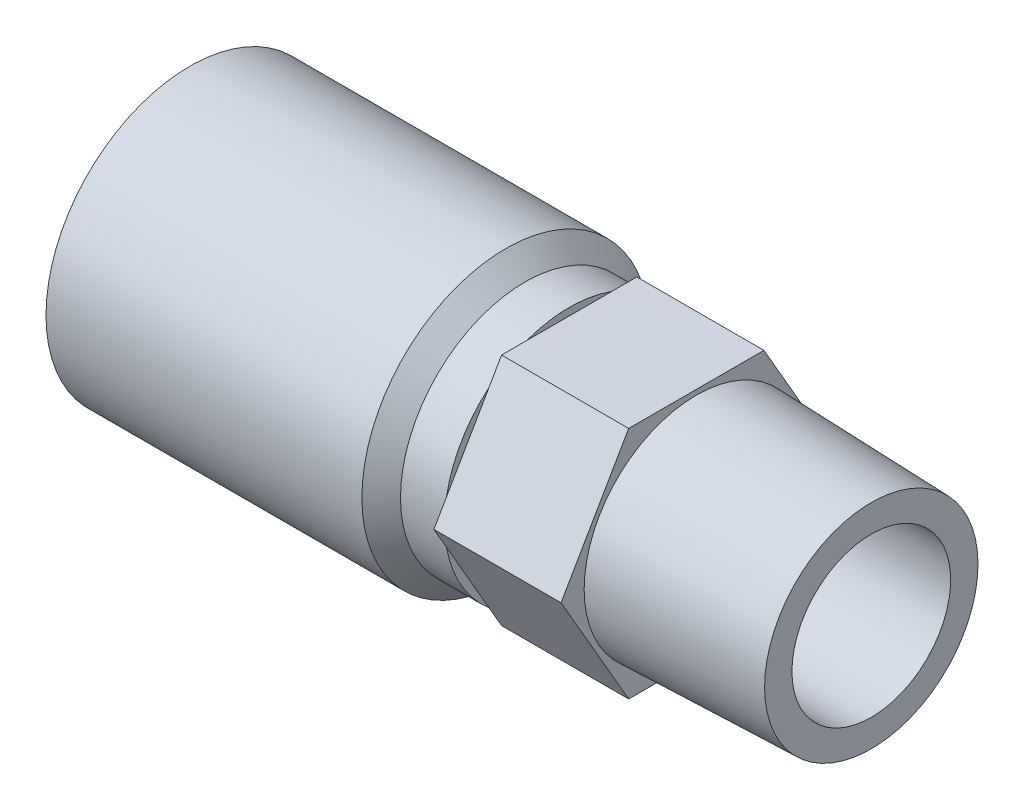
ISO-10303-21;
HEADER;
FILE_DESCRIPTION(('STEP AP214'),'2;1');
FILE_NAME('part.step','',(''),(''),'','','');
FILE_SCHEMA(('AUTOMOTIVE_DESIGN { 1 0 10303 214 1 1 1 1 }'));
ENDSEC;
DATA;
#1=APPLICATION_CONTEXT('core data for automotive mechanical design processes');
#2=APPLICATION_PROTOCOL_DEFINITION('international standard','automotive_design',2000,#1);
#3=PRODUCT_CONTEXT('',#1,'mechanical');
#4=PRODUCT('Part','Part','',(#3));
#5=PRODUCT_RELATED_PRODUCT_CATEGORY('part','',(#4));
#6=PRODUCT_DEFINITION_FORMATION('','',#4);
#7=PRODUCT_DEFINITION_CONTEXT('part definition',#1,'design');
#8=PRODUCT_DEFINITION('design','',#6,#7);
#9=PRODUCT_DEFINITION_SHAPE('','',#8);
#10=(LENGTH_UNIT() NAMED_UNIT(*) SI_UNIT(.MILLI.,.METRE.));
#11=(NAMED_UNIT(*) PLANE_ANGLE_UNIT() SI_UNIT($,.RADIAN.));
#12=(NAMED_UNIT(*) SI_UNIT($,.STERADIAN.) SOLID_ANGLE_UNIT());
#13=UNCERTAINTY_MEASURE_WITH_UNIT(LENGTH_MEASURE(1.E-05),#10,'distance_accuracy_value','');
#14=(GEOMETRIC_REPRESENTATION_CONTEXT(3) GLOBAL_UNCERTAINTY_ASSIGNED_CONTEXT((#13)) GLOBAL_UNIT_ASSIGNED_CONTEXT((#10,
#11,#12)) REPRESENTATION_CONTEXT('',''));
#15=CARTESIAN_POINT('',(0.,0.,0.));
#16=DIRECTION('',(0.,0.,1.));
#17=DIRECTION('',(1.,0.,0.));
#18=AXIS2_PLACEMENT_3D('',#15,#16,#17);
#19=CARTESIAN_POINT('',(-42.1005,0.,0.));
#20=DIRECTION('',(-1.,0.,0.));
#21=DIRECTION('',(0.,0.,1.));
#22=AXIS2_PLACEMENT_3D('',#19,#20,#21);
#23=CYLINDRICAL_SURFACE('',#22,16.5735);
#24=CARTESIAN_POINT('',(-42.1005000148879,0.,0.));
#25=DIRECTION('',(-1.,0.,0.));
#26=DIRECTION('',(0.,0.,1.));
#27=AXIS2_PLACEMENT_3D('',#24,#25,#26);
#28=CIRCLE('',#27,16.5734999851121);
#29=CARTESIAN_POINT('',(-42.1005000148879,0.,16.5734999851121));
#30=VERTEX_POINT('',#29);
#31=EDGE_CURVE('E146',#30,#30,#28,.F.);
#32=ORIENTED_EDGE('',*,*,#31,.F.);
#33=EDGE_LOOP('',(#32));
#34=FACE_BOUND('',#33,.T.);
#35=CARTESIAN_POINT('',(-78.486,0.,0.));
#36=DIRECTION('',(-1.,0.,0.));
#37=DIRECTION('',(0.,0.,1.));
#38=AXIS2_PLACEMENT_3D('',#35,#36,#37);
#39=CIRCLE('',#38,16.5735);
#40=CARTESIAN_POINT('',(-78.486,0.,16.5735));
#41=VERTEX_POINT('',#40);
#42=EDGE_CURVE('E19',#41,#41,#39,.T.);
#43=ORIENTED_EDGE('',*,*,#42,.F.);
#44=EDGE_LOOP('',(#43));
#45=FACE_BOUND('',#44,.T.);
#46=ADVANCED_FACE('F16',(#34,#45),#23,.T.);
#47=CARTESIAN_POINT('',(-78.486,0.,15.20825));
#48=DIRECTION('',(-1.,0.,0.));
#49=DIRECTION('',(0.,0.,1.));
#50=AXIS2_PLACEMENT_3D('',#47,#48,#49);
#51=PLANE('',#50);
#52=CARTESIAN_POINT('',(-78.486,0.,0.));
#53=DIRECTION('',(-1.,0.,0.));
#54=DIRECTION('',(0.,0.,1.));
#55=AXIS2_PLACEMENT_3D('',#52,#53,#54);
#56=CIRCLE('',#55,13.843);
#57=CARTESIAN_POINT('',(-78.486,0.,13.843));
#58=VERTEX_POINT('',#57);
#59=EDGE_CURVE('E145',#58,#58,#56,.T.);
#60=ORIENTED_EDGE('',*,*,#59,.F.);
#61=EDGE_LOOP('',(#60));
#62=FACE_BOUND('',#61,.T.);
#63=ORIENTED_EDGE('',*,*,#42,.T.);
#64=EDGE_LOOP('',(#63));
#65=FACE_BOUND('',#64,.T.);
#66=ADVANCED_FACE('F204',(#62,#65),#51,.T.);
#67=CARTESIAN_POINT('',(-39.8779999851121,0.,0.));
#68=DIRECTION('',(-1.,0.,0.));
#69=DIRECTION('',(0.,0.,1.));
#70=AXIS2_PLACEMENT_3D('',#67,#68,#69);
#71=CONICAL_SURFACE('',#70,14.3510000148879,0.785398149999998);
#72=CARTESIAN_POINT('',(-39.878,0.,0.));
#73=DIRECTION('',(-1.,0.,0.));
#74=DIRECTION('',(0.,0.,1.));
#75=AXIS2_PLACEMENT_3D('',#72,#73,#74);
#76=CIRCLE('',#75,14.351);
#77=CARTESIAN_POINT('',(-39.878,0.,14.351));
#78=VERTEX_POINT('',#77);
#79=EDGE_CURVE('E142',#78,#78,#76,.F.);
#80=ORIENTED_EDGE('',*,*,#79,.F.);
#81=EDGE_LOOP('',(#80));
#82=FACE_BOUND('',#81,.T.);
#83=ORIENTED_EDGE('',*,*,#31,.T.);
#84=EDGE_LOOP('',(#83));
#85=FACE_BOUND('',#84,.T.);
#86=ADVANCED_FACE('F207',(#82,#85),#71,.T.);
#87=CARTESIAN_POINT('',(-41.91,0.,0.));
#88=DIRECTION('',(-1.,0.,0.));
#89=DIRECTION('',(0.,0.,1.));
#90=AXIS2_PLACEMENT_3D('',#87,#88,#89);
#91=CYLINDRICAL_SURFACE('',#90,13.843);
#92=CARTESIAN_POINT('',(-41.91,0.,0.));
#93=DIRECTION('',(-1.,0.,0.));
#94=DIRECTION('',(0.,0.,1.));
#95=AXIS2_PLACEMENT_3D('',#92,#93,#94);
#96=CIRCLE('',#95,13.843);
#97=CARTESIAN_POINT('',(-41.91,0.,13.843));
#98=VERTEX_POINT('',#97);
#99=EDGE_CURVE('E129',#98,#98,#96,.T.);
#100=ORIENTED_EDGE('',*,*,#99,.F.);
#101=EDGE_LOOP('',(#100));
#102=FACE_BOUND('',#101,.T.);
#103=ORIENTED_EDGE('',*,*,#59,.T.);
#104=EDGE_LOOP('',(#103));
#105=FACE_BOUND('',#104,.T.);
#106=ADVANCED_FACE('F202',(#102,#105),#91,.F.);
#107=CARTESIAN_POINT('',(-34.798,0.,0.));
#108=DIRECTION('',(-1.,0.,0.));
#109=DIRECTION('',(0.,0.,1.));
#110=AXIS2_PLACEMENT_3D('',#107,#108,#109);
#111=CYLINDRICAL_SURFACE('',#110,14.351);
#112=CARTESIAN_POINT('',(-34.798,0.,0.));
#113=DIRECTION('',(-1.,0.,0.));
#114=DIRECTION('',(0.,0.,1.));
#115=AXIS2_PLACEMENT_3D('',#112,#113,#114);
#116=CIRCLE('',#115,14.351);
#117=CARTESIAN_POINT('',(-34.798,2.51574820526495,14.128772486232));
#118=VERTEX_POINT('',#117);
#119=CARTESIAN_POINT('',(-34.798,-2.51574820526493,14.128772486232));
#120=VERTEX_POINT('',#119);
#121=EDGE_CURVE('E194',#118,#120,#116,.F.);
#122=ORIENTED_EDGE('',*,*,#121,.F.);
#123=CARTESIAN_POINT('',(-34.798,0.,0.));
#124=DIRECTION('',(-1.,0.,0.));
#125=DIRECTION('',(0.,0.,1.));
#126=AXIS2_PLACEMENT_3D('',#123,#124,#125);
#127=CIRCLE('',#126,14.351);
#128=CARTESIAN_POINT('',(-34.798,10.9780017947351,9.24308809840056));
#129=VERTEX_POINT('',#128);
#130=EDGE_CURVE('E109',#129,#118,#127,.F.);
#131=ORIENTED_EDGE('',*,*,#130,.F.);
#132=CARTESIAN_POINT('',(-34.798,0.,0.));
#133=DIRECTION('',(-1.,0.,0.));
#134=DIRECTION('',(0.,0.,1.));
#135=AXIS2_PLACEMENT_3D('',#132,#133,#134);
#136=CIRCLE('',#135,14.351);
#137=CARTESIAN_POINT('',(-34.798,13.49375,4.88568438783145));
#138=VERTEX_POINT('',#137);
#139=EDGE_CURVE('E104',#138,#129,#136,.F.);
#140=ORIENTED_EDGE('',*,*,#139,.F.);
#141=CARTESIAN_POINT('',(-34.798,0.,0.));
#142=DIRECTION('',(-1.,0.,0.));
#143=DIRECTION('',(0.,0.,1.));
#144=AXIS2_PLACEMENT_3D('',#141,#142,#143);
#145=CIRCLE('',#144,14.351);
#146=CARTESIAN_POINT('',(-34.798,13.49375,-4.88568438783144));
#147=VERTEX_POINT('',#146);
#148=EDGE_CURVE('E101',#147,#138,#145,.F.);
#149=ORIENTED_EDGE('',*,*,#148,.F.);
#150=CARTESIAN_POINT('',(-34.798,0.,0.));
#151=DIRECTION('',(-1.,0.,0.));
#152=DIRECTION('',(0.,0.,1.));
#153=AXIS2_PLACEMENT_3D('',#150,#151,#152);
#154=CIRCLE('',#153,14.351);
#155=CARTESIAN_POINT('',(-34.798,10.9780017947351,-9.24308809840056));
#156=VERTEX_POINT('',#155);
#157=EDGE_CURVE('E177',#156,#147,#154,.F.);
#158=ORIENTED_EDGE('',*,*,#157,.F.);
#159=CARTESIAN_POINT('',(-34.798,0.,0.));
#160=DIRECTION('',(-1.,0.,0.));
#161=DIRECTION('',(0.,0.,1.));
#162=AXIS2_PLACEMENT_3D('',#159,#160,#161);
#163=CIRCLE('',#162,14.351);
#164=CARTESIAN_POINT('',(-34.798,2.51574820526495,-14.128772486232));
#165=VERTEX_POINT('',#164);
#166=EDGE_CURVE('E171',#165,#156,#163,.F.);
#167=ORIENTED_EDGE('',*,*,#166,.F.);
#168=CARTESIAN_POINT('',(-34.798,0.,0.));
#169=DIRECTION('',(-1.,0.,0.));
#170=DIRECTION('',(0.,0.,1.));
#171=AXIS2_PLACEMENT_3D('',#168,#169,#170);
#172=CIRCLE('',#171,14.351);
#173=CARTESIAN_POINT('',(-34.798,-2.51574820526493,-14.128772486232));
#174=VERTEX_POINT('',#173);
#175=EDGE_CURVE('E174',#174,#165,#172,.F.);
#176=ORIENTED_EDGE('',*,*,#175,.F.);
#177=CARTESIAN_POINT('',(-34.798,0.,0.));
#178=DIRECTION('',(-1.,0.,0.));
#179=DIRECTION('',(0.,0.,1.));
#180=AXIS2_PLACEMENT_3D('',#177,#178,#179);
#181=CIRCLE('',#180,14.351);
#182=CARTESIAN_POINT('',(-34.798,-10.978001794735,-9.24308809840057));
#183=VERTEX_POINT('',#182);
#184=EDGE_CURVE('E179',#183,#174,#181,.F.);
#185=ORIENTED_EDGE('',*,*,#184,.F.);
#186=CARTESIAN_POINT('',(-34.798,0.,0.));
#187=DIRECTION('',(-1.,0.,0.));
#188=DIRECTION('',(0.,0.,1.));
#189=AXIS2_PLACEMENT_3D('',#186,#187,#188);
#190=CIRCLE('',#189,14.351);
#191=CARTESIAN_POINT('',(-34.798,-13.49375,-4.88568438783145));
#192=VERTEX_POINT('',#191);
#193=EDGE_CURVE('E182',#192,#183,#190,.F.);
#194=ORIENTED_EDGE('',*,*,#193,.F.);
#195=CARTESIAN_POINT('',(-34.798,0.,0.));
#196=DIRECTION('',(-1.,0.,0.));
#197=DIRECTION('',(0.,0.,1.));
#198=AXIS2_PLACEMENT_3D('',#195,#196,#197);
#199=CIRCLE('',#198,14.351);
#200=CARTESIAN_POINT('',(-34.798,-13.49375,4.88568438783144));
#201=VERTEX_POINT('',#200);
#202=EDGE_CURVE('E185',#201,#192,#199,.F.);
#203=ORIENTED_EDGE('',*,*,#202,.F.);
#204=CARTESIAN_POINT('',(-34.798,0.,0.));
#205=DIRECTION('',(-1.,0.,0.));
#206=DIRECTION('',(0.,0.,1.));
#207=AXIS2_PLACEMENT_3D('',#204,#205,#206);
#208=CIRCLE('',#207,14.351);
#209=CARTESIAN_POINT('',(-34.798,-10.9780017947351,9.24308809840054));
#210=VERTEX_POINT('',#209);
#211=EDGE_CURVE('E188',#210,#201,#208,.F.);
#212=ORIENTED_EDGE('',*,*,#211,.F.);
#213=CARTESIAN_POINT('',(-34.798,0.,0.));
#214=DIRECTION('',(-1.,0.,0.));
#215=DIRECTION('',(0.,0.,1.));
#216=AXIS2_PLACEMENT_3D('',#213,#214,#215);
#217=CIRCLE('',#216,14.351);
#218=EDGE_CURVE('E191',#120,#210,#217,.F.);
#219=ORIENTED_EDGE('',*,*,#218,.F.);
#220=EDGE_LOOP('',(#122,#131,#140,#149,#158,#167,#176,#185,#194,#203,#212,#219));
#221=FACE_BOUND('',#220,.T.);
#222=ORIENTED_EDGE('',*,*,#79,.T.);
#223=EDGE_LOOP('',(#222));
#224=FACE_BOUND('',#223,.T.);
#225=ADVANCED_FACE('F106',(#221,#224),#111,.T.);
#226=CARTESIAN_POINT('',(-41.91,0.,11.684));
#227=DIRECTION('',(-1.,0.,0.));
#228=DIRECTION('',(0.,0.,1.));
#229=AXIS2_PLACEMENT_3D('',#226,#227,#228);
#230=PLANE('',#229);
#231=CARTESIAN_POINT('',(-41.91,0.,0.));
#232=DIRECTION('',(-1.,0.,0.));
#233=DIRECTION('',(0.,0.,1.));
#234=AXIS2_PLACEMENT_3D('',#231,#232,#233);
#235=CIRCLE('',#234,9.525);
#236=CARTESIAN_POINT('',(-41.91,0.,9.52500000000001));
#237=VERTEX_POINT('',#236);
#238=EDGE_CURVE('E122',#237,#237,#235,.T.);
#239=ORIENTED_EDGE('',*,*,#238,.F.);
#240=EDGE_LOOP('',(#239));
#241=FACE_BOUND('',#240,.T.);
#242=ORIENTED_EDGE('',*,*,#99,.T.);
#243=EDGE_LOOP('',(#242));
#244=FACE_BOUND('',#243,.T.);
#245=ADVANCED_FACE('F318',(#241,#244),#230,.T.);
#246=CARTESIAN_POINT('',(-34.798,0.,0.));
#247=DIRECTION('',(1.,0.,0.));
#248=DIRECTION('',(0.,0.,-1.));
#249=AXIS2_PLACEMENT_3D('',#246,#247,#248);
#250=PLANE('',#249);
#251=ORIENTED_EDGE('',*,*,#148,.T.);
#252=DIRECTION('',(0.,0.,1.));
#253=VECTOR('',#252,1.);
#254=CARTESIAN_POINT('',(-34.798,13.49375,-7.79062019487752));
#255=LINE('',#254,#253);
#256=EDGE_CURVE('E127',#147,#138,#255,.T.);
#257=ORIENTED_EDGE('',*,*,#256,.F.);
#258=EDGE_LOOP('',(#251,#257));
#259=FACE_BOUND('',#258,.T.);
#260=ADVANCED_FACE('F126',(#259),#250,.T.);
#261=CARTESIAN_POINT('',(-34.798,0.,14.9661201948775));
#262=DIRECTION('',(-1.,0.,0.));
#263=DIRECTION('',(0.,0.,1.));
#264=AXIS2_PLACEMENT_3D('',#261,#262,#263);
#265=PLANE('',#264);
#266=ORIENTED_EDGE('',*,*,#139,.T.);
#267=DIRECTION('',(0.,-0.866025403784439,0.5));
#268=VECTOR('',#267,1.);
#269=CARTESIAN_POINT('',(-34.798,13.49375,7.79062019487753));
#270=LINE('',#269,#268);
#271=CARTESIAN_POINT('',(-34.798,13.49375,7.79062019487752));
#272=VERTEX_POINT('',#271);
#273=EDGE_CURVE('E117',#272,#129,#270,.T.);
#274=ORIENTED_EDGE('',*,*,#273,.F.);
#275=DIRECTION('',(0.,0.,1.));
#276=VECTOR('',#275,1.);
#277=CARTESIAN_POINT('',(-34.798,13.49375,-7.79062019487752));
#278=LINE('',#277,#276);
#279=EDGE_CURVE('E114',#138,#272,#278,.T.);
#280=ORIENTED_EDGE('',*,*,#279,.F.);
#281=EDGE_LOOP('',(#266,#274,#280));
#282=FACE_BOUND('',#281,.T.);
#283=ADVANCED_FACE('F115',(#282),#265,.T.);
#284=CARTESIAN_POINT('',(-34.798,0.,0.));
#285=DIRECTION('',(1.,0.,0.));
#286=DIRECTION('',(0.,0.,-1.));
#287=AXIS2_PLACEMENT_3D('',#284,#285,#286);
#288=PLANE('',#287);
#289=ORIENTED_EDGE('',*,*,#130,.T.);
#290=DIRECTION('',(0.,-0.866025403784439,0.5));
#291=VECTOR('',#290,1.);
#292=CARTESIAN_POINT('',(-34.798,13.49375,7.79062019487753));
#293=LINE('',#292,#291);
#294=EDGE_CURVE('E531',#129,#118,#293,.T.);
#295=ORIENTED_EDGE('',*,*,#294,.F.);
#296=EDGE_LOOP('',(#289,#295));
#297=FACE_BOUND('',#296,.T.);
#298=ADVANCED_FACE('F309',(#297),#288,.T.);
#299=CARTESIAN_POINT('',(-34.798,0.,14.9661201948775));
#300=DIRECTION('',(-1.,0.,0.));
#301=DIRECTION('',(0.,0.,1.));
#302=AXIS2_PLACEMENT_3D('',#299,#300,#301);
#303=PLANE('',#302);
#304=DIRECTION('',(0.,-0.866025403784439,0.5));
#305=VECTOR('',#304,1.);
#306=CARTESIAN_POINT('',(-34.798,13.49375,7.79062019487753));
#307=LINE('',#306,#305);
#308=CARTESIAN_POINT('',(-34.798,0.,15.581240389755));
#309=VERTEX_POINT('',#308);
#310=EDGE_CURVE('E133',#118,#309,#307,.T.);
#311=ORIENTED_EDGE('',*,*,#310,.F.);
#312=ORIENTED_EDGE('',*,*,#121,.T.);
#313=DIRECTION('',(0.,-0.866025403784439,-0.5));
#314=VECTOR('',#313,1.);
#315=CARTESIAN_POINT('',(-34.798,0.,15.581240389755));
#316=LINE('',#315,#314);
#317=EDGE_CURVE('E567',#309,#120,#316,.T.);
#318=ORIENTED_EDGE('',*,*,#317,.F.);
#319=EDGE_LOOP('',(#311,#312,#318));
#320=FACE_BOUND('',#319,.T.);
#321=ADVANCED_FACE('F305',(#320),#303,.T.);
#322=CARTESIAN_POINT('',(-34.798,0.,0.));
#323=DIRECTION('',(1.,0.,0.));
#324=DIRECTION('',(0.,0.,-1.));
#325=AXIS2_PLACEMENT_3D('',#322,#323,#324);
#326=PLANE('',#325);
#327=ORIENTED_EDGE('',*,*,#218,.T.);
#328=DIRECTION('',(0.,-0.866025403784439,-0.5));
#329=VECTOR('',#328,1.);
#330=CARTESIAN_POINT('',(-34.798,0.,15.581240389755));
#331=LINE('',#330,#329);
#332=EDGE_CURVE('E568',#120,#210,#331,.T.);
#333=ORIENTED_EDGE('',*,*,#332,.F.);
#334=EDGE_LOOP('',(#327,#333));
#335=FACE_BOUND('',#334,.T.);
#336=ADVANCED_FACE('F301',(#335),#326,.T.);
#337=CARTESIAN_POINT('',(-34.798,0.,14.9661201948775));
#338=DIRECTION('',(-1.,0.,0.));
#339=DIRECTION('',(0.,0.,1.));
#340=AXIS2_PLACEMENT_3D('',#337,#338,#339);
#341=PLANE('',#340);
#342=DIRECTION('',(0.,-0.866025403784439,-0.5));
#343=VECTOR('',#342,1.);
#344=CARTESIAN_POINT('',(-34.798,0.,15.581240389755));
#345=LINE('',#344,#343);
#346=CARTESIAN_POINT('',(-34.798,-13.49375,7.7906201948775));
#347=VERTEX_POINT('',#346);
#348=EDGE_CURVE('E534',#210,#347,#345,.T.);
#349=ORIENTED_EDGE('',*,*,#348,.F.);
#350=ORIENTED_EDGE('',*,*,#211,.T.);
#351=DIRECTION('',(0.,0.,-1.));
#352=VECTOR('',#351,1.);
#353=CARTESIAN_POINT('',(-34.798,-13.49375,7.7906201948775));
#354=LINE('',#353,#352);
#355=EDGE_CURVE('E585',#347,#201,#354,.T.);
#356=ORIENTED_EDGE('',*,*,#355,.F.);
#357=EDGE_LOOP('',(#349,#350,#356));
#358=FACE_BOUND('',#357,.T.);
#359=ADVANCED_FACE('F297',(#358),#341,.T.);
#360=CARTESIAN_POINT('',(-34.798,0.,0.));
#361=DIRECTION('',(1.,0.,0.));
#362=DIRECTION('',(0.,0.,-1.));
#363=AXIS2_PLACEMENT_3D('',#360,#361,#362);
#364=PLANE('',#363);
#365=ORIENTED_EDGE('',*,*,#202,.T.);
#366=DIRECTION('',(0.,0.,-1.));
#367=VECTOR('',#366,1.);
#368=CARTESIAN_POINT('',(-34.798,-13.49375,7.7906201948775));
#369=LINE('',#368,#367);
#370=EDGE_CURVE('E586',#201,#192,#369,.T.);
#371=ORIENTED_EDGE('',*,*,#370,.F.);
#372=EDGE_LOOP('',(#365,#371));
#373=FACE_BOUND('',#372,.T.);
#374=ADVANCED_FACE('F293',(#373),#364,.T.);
#375=CARTESIAN_POINT('',(-34.798,0.,14.9661201948775));
#376=DIRECTION('',(-1.,0.,0.));
#377=DIRECTION('',(0.,0.,1.));
#378=AXIS2_PLACEMENT_3D('',#375,#376,#377);
#379=PLANE('',#378);
#380=ORIENTED_EDGE('',*,*,#193,.T.);
#381=DIRECTION('',(0.,0.866025403784439,-0.5));
#382=VECTOR('',#381,1.);
#383=CARTESIAN_POINT('',(-34.798,-13.49375,-7.79062019487751));
#384=LINE('',#383,#382);
#385=CARTESIAN_POINT('',(-34.798,-13.49375,-7.79062019487751));
#386=VERTEX_POINT('',#385);
#387=EDGE_CURVE('E607',#386,#183,#384,.T.);
#388=ORIENTED_EDGE('',*,*,#387,.F.);
#389=DIRECTION('',(0.,0.,-1.));
#390=VECTOR('',#389,1.);
#391=CARTESIAN_POINT('',(-34.798,-13.49375,7.7906201948775));
#392=LINE('',#391,#390);
#393=EDGE_CURVE('E571',#192,#386,#392,.T.);
#394=ORIENTED_EDGE('',*,*,#393,.F.);
#395=EDGE_LOOP('',(#380,#388,#394));
#396=FACE_BOUND('',#395,.T.);
#397=ADVANCED_FACE('F289',(#396),#379,.T.);
#398=CARTESIAN_POINT('',(-34.798,0.,0.));
#399=DIRECTION('',(1.,0.,0.));
#400=DIRECTION('',(0.,0.,-1.));
#401=AXIS2_PLACEMENT_3D('',#398,#399,#400);
#402=PLANE('',#401);
#403=ORIENTED_EDGE('',*,*,#184,.T.);
#404=DIRECTION('',(0.,0.866025403784439,-0.5));
#405=VECTOR('',#404,1.);
#406=CARTESIAN_POINT('',(-34.798,-13.49375,-7.79062019487751));
#407=LINE('',#406,#405);
#408=EDGE_CURVE('E608',#183,#174,#407,.T.);
#409=ORIENTED_EDGE('',*,*,#408,.F.);
#410=EDGE_LOOP('',(#403,#409));
#411=FACE_BOUND('',#410,.T.);
#412=ADVANCED_FACE('F285',(#411),#402,.T.);
#413=CARTESIAN_POINT('',(-34.798,0.,14.9661201948775));
#414=DIRECTION('',(-1.,0.,0.));
#415=DIRECTION('',(0.,0.,1.));
#416=AXIS2_PLACEMENT_3D('',#413,#414,#415);
#417=PLANE('',#416);
#418=ORIENTED_EDGE('',*,*,#157,.T.);
#419=DIRECTION('',(0.,0.,1.));
#420=VECTOR('',#419,1.);
#421=CARTESIAN_POINT('',(-34.798,13.49375,-7.79062019487752));
#422=LINE('',#421,#420);
#423=CARTESIAN_POINT('',(-34.798,13.49375,-7.79062019487752));
#424=VERTEX_POINT('',#423);
#425=EDGE_CURVE('E121',#424,#147,#422,.T.);
#426=ORIENTED_EDGE('',*,*,#425,.F.);
#427=DIRECTION('',(0.,0.866025403784439,0.5));
#428=VECTOR('',#427,1.);
#429=CARTESIAN_POINT('',(-34.798,0.,-15.581240389755));
#430=LINE('',#429,#428);
#431=EDGE_CURVE('E611',#156,#424,#430,.T.);
#432=ORIENTED_EDGE('',*,*,#431,.F.);
#433=EDGE_LOOP('',(#418,#426,#432));
#434=FACE_BOUND('',#433,.T.);
#435=ADVANCED_FACE('F281',(#434),#417,.T.);
#436=CARTESIAN_POINT('',(-34.798,0.,14.9661201948775));
#437=DIRECTION('',(-1.,0.,0.));
#438=DIRECTION('',(0.,0.,1.));
#439=AXIS2_PLACEMENT_3D('',#436,#437,#438);
#440=PLANE('',#439);
#441=DIRECTION('',(0.,0.866025403784439,-0.5));
#442=VECTOR('',#441,1.);
#443=CARTESIAN_POINT('',(-34.798,-13.49375,-7.79062019487751));
#444=LINE('',#443,#442);
#445=CARTESIAN_POINT('',(-34.798,0.,-15.581240389755));
#446=VERTEX_POINT('',#445);
#447=EDGE_CURVE('E589',#174,#446,#444,.T.);
#448=ORIENTED_EDGE('',*,*,#447,.F.);
#449=ORIENTED_EDGE('',*,*,#175,.T.);
#450=DIRECTION('',(0.,0.866025403784439,0.5));
#451=VECTOR('',#450,1.);
#452=CARTESIAN_POINT('',(-34.798,0.,-15.581240389755));
#453=LINE('',#452,#451);
#454=EDGE_CURVE('E636',#446,#165,#453,.T.);
#455=ORIENTED_EDGE('',*,*,#454,.F.);
#456=EDGE_LOOP('',(#448,#449,#455));
#457=FACE_BOUND('',#456,.T.);
#458=ADVANCED_FACE('F277',(#457),#440,.T.);
#459=CARTESIAN_POINT('',(-34.798,0.,0.));
#460=DIRECTION('',(1.,0.,0.));
#461=DIRECTION('',(0.,0.,-1.));
#462=AXIS2_PLACEMENT_3D('',#459,#460,#461);
#463=PLANE('',#462);
#464=ORIENTED_EDGE('',*,*,#166,.T.);
#465=DIRECTION('',(0.,0.866025403784439,0.5));
#466=VECTOR('',#465,1.);
#467=CARTESIAN_POINT('',(-34.798,0.,-15.581240389755));
#468=LINE('',#467,#466);
#469=EDGE_CURVE('E168',#165,#156,#468,.T.);
#470=ORIENTED_EDGE('',*,*,#469,.F.);
#471=EDGE_LOOP('',(#464,#470));
#472=FACE_BOUND('',#471,.T.);
#473=ADVANCED_FACE('F273',(#472),#463,.T.);
#474=CARTESIAN_POINT('',(-41.91,0.,0.));
#475=DIRECTION('',(-1.,0.,0.));
#476=DIRECTION('',(0.,0.,1.));
#477=AXIS2_PLACEMENT_3D('',#474,#475,#476);
#478=CYLINDRICAL_SURFACE('',#477,9.525);
#479=CARTESIAN_POINT('',(-78.486,0.,0.));
#480=DIRECTION('',(-1.,0.,0.));
#481=DIRECTION('',(0.,0.,1.));
#482=AXIS2_PLACEMENT_3D('',#479,#480,#481);
#483=CIRCLE('',#482,9.525);
#484=CARTESIAN_POINT('',(-78.486,0.,9.52500000000003));
#485=VERTEX_POINT('',#484);
#486=EDGE_CURVE('E164',#485,#485,#483,.T.);
#487=ORIENTED_EDGE('',*,*,#486,.F.);
#488=EDGE_LOOP('',(#487));
#489=FACE_BOUND('',#488,.T.);
#490=ORIENTED_EDGE('',*,*,#238,.T.);
#491=EDGE_LOOP('',(#490));
#492=FACE_BOUND('',#491,.T.);
#493=ADVANCED_FACE('F270',(#489,#492),#478,.T.);
#494=CARTESIAN_POINT('',(-20.1549,13.49375,-7.79062019487752));
#495=DIRECTION('',(0.,1.,0.));
#496=DIRECTION('',(0.,0.,1.));
#497=AXIS2_PLACEMENT_3D('',#494,#495,#496);
#498=PLANE('',#497);
#499=ORIENTED_EDGE('',*,*,#425,.T.);
#500=ORIENTED_EDGE('',*,*,#256,.T.);
#501=ORIENTED_EDGE('',*,*,#279,.T.);
#502=DIRECTION('',(1.,0.,0.));
#503=VECTOR('',#502,1.);
#504=CARTESIAN_POINT('',(-20.1549,13.49375,7.79062019487752));
#505=LINE('',#504,#503);
#506=CARTESIAN_POINT('',(-20.1549,13.49375,7.79062019487752));
#507=VERTEX_POINT('',#506);
#508=EDGE_CURVE('E135',#507,#272,#505,.F.);
#509=ORIENTED_EDGE('',*,*,#508,.F.);
#510=DIRECTION('',(0.,0.,-1.));
#511=VECTOR('',#510,1.);
#512=CARTESIAN_POINT('',(-20.1549,13.49375,14.2503323198775));
#513=LINE('',#512,#511);
#514=CARTESIAN_POINT('',(-20.1549,13.49375,-7.79062019487752));
#515=VERTEX_POINT('',#514);
#516=EDGE_CURVE('E167',#515,#507,#513,.F.);
#517=ORIENTED_EDGE('',*,*,#516,.F.);
#518=DIRECTION('',(1.,0.,0.));
#519=VECTOR('',#518,1.);
#520=CARTESIAN_POINT('',(-20.1549,13.49375,-7.79062019487753));
#521=LINE('',#520,#519);
#522=EDGE_CURVE('E620',#424,#515,#521,.T.);
#523=ORIENTED_EDGE('',*,*,#522,.F.);
#524=EDGE_LOOP('',(#499,#500,#501,#509,#517,#523));
#525=FACE_BOUND('',#524,.T.);
#526=ADVANCED_FACE('F131',(#525),#498,.T.);
#527=CARTESIAN_POINT('',(-20.1549,13.49375,7.79062019487752));
#528=DIRECTION('',(0.,0.5,0.866025403784439));
#529=DIRECTION('',(0.,-0.866025403784439,0.5));
#530=AXIS2_PLACEMENT_3D('',#527,#528,#529);
#531=PLANE('',#530);
#532=ORIENTED_EDGE('',*,*,#273,.T.);
#533=ORIENTED_EDGE('',*,*,#294,.T.);
#534=ORIENTED_EDGE('',*,*,#310,.T.);
#535=DIRECTION('',(1.,0.,0.));
#536=VECTOR('',#535,1.);
#537=CARTESIAN_POINT('',(-20.1549,0.,15.581240389755));
#538=LINE('',#537,#536);
#539=CARTESIAN_POINT('',(-20.1549,0.,15.581240389755));
#540=VERTEX_POINT('',#539);
#541=EDGE_CURVE('E536',#540,#309,#538,.F.);
#542=ORIENTED_EDGE('',*,*,#541,.F.);
#543=DIRECTION('',(0.,-0.866025403784439,0.499999999999999));
#544=VECTOR('',#543,1.);
#545=CARTESIAN_POINT('',(-20.1549,13.49375,7.79062019487752));
#546=LINE('',#545,#544);
#547=EDGE_CURVE('E547',#507,#540,#546,.T.);
#548=ORIENTED_EDGE('',*,*,#547,.F.);
#549=ORIENTED_EDGE('',*,*,#508,.T.);
#550=EDGE_LOOP('',(#532,#533,#534,#542,#548,#549));
#551=FACE_BOUND('',#550,.T.);
#552=ADVANCED_FACE('F263',(#551),#531,.T.);
#553=CARTESIAN_POINT('',(-20.1549,0.,15.581240389755));
#554=DIRECTION('',(0.,-0.5,0.866025403784439));
#555=DIRECTION('',(0.,-0.866025403784439,-0.5));
#556=AXIS2_PLACEMENT_3D('',#553,#554,#555);
#557=PLANE('',#556);
#558=ORIENTED_EDGE('',*,*,#317,.T.);
#559=ORIENTED_EDGE('',*,*,#332,.T.);
#560=ORIENTED_EDGE('',*,*,#348,.T.);
#561=DIRECTION('',(1.,0.,0.));
#562=VECTOR('',#561,1.);
#563=CARTESIAN_POINT('',(-20.1549,-13.49375,7.7906201948775));
#564=LINE('',#563,#562);
#565=CARTESIAN_POINT('',(-20.1549,-13.49375,7.7906201948775));
#566=VERTEX_POINT('',#565);
#567=EDGE_CURVE('E582',#566,#347,#564,.F.);
#568=ORIENTED_EDGE('',*,*,#567,.F.);
#569=DIRECTION('',(0.,-0.866025403784438,-0.5));
#570=VECTOR('',#569,1.);
#571=CARTESIAN_POINT('',(-20.1549,0.,15.581240389755));
#572=LINE('',#571,#570);
#573=EDGE_CURVE('E552',#540,#566,#572,.T.);
#574=ORIENTED_EDGE('',*,*,#573,.F.);
#575=ORIENTED_EDGE('',*,*,#541,.T.);
#576=EDGE_LOOP('',(#558,#559,#560,#568,#574,#575));
#577=FACE_BOUND('',#576,.T.);
#578=ADVANCED_FACE('F259',(#577),#557,.T.);
#579=CARTESIAN_POINT('',(-20.1549,-13.49375,7.7906201948775));
#580=DIRECTION('',(0.,-1.,0.));
#581=DIRECTION('',(0.,0.,-1.));
#582=AXIS2_PLACEMENT_3D('',#579,#580,#581);
#583=PLANE('',#582);
#584=ORIENTED_EDGE('',*,*,#355,.T.);
#585=ORIENTED_EDGE('',*,*,#370,.T.);
#586=ORIENTED_EDGE('',*,*,#393,.T.);
#587=DIRECTION('',(1.,0.,0.));
#588=VECTOR('',#587,1.);
#589=CARTESIAN_POINT('',(-20.1549,-13.49375,-7.79062019487752));
#590=LINE('',#589,#588);
#591=CARTESIAN_POINT('',(-20.1549,-13.49375,-7.79062019487752));
#592=VERTEX_POINT('',#591);
#593=EDGE_CURVE('E604',#592,#386,#590,.F.);
#594=ORIENTED_EDGE('',*,*,#593,.F.);
#595=DIRECTION('',(0.,0.,-1.));
#596=VECTOR('',#595,1.);
#597=CARTESIAN_POINT('',(-20.1549,-13.49375,14.2503323198775));
#598=LINE('',#597,#596);
#599=EDGE_CURVE('E556',#566,#592,#598,.T.);
#600=ORIENTED_EDGE('',*,*,#599,.F.);
#601=ORIENTED_EDGE('',*,*,#567,.T.);
#602=EDGE_LOOP('',(#584,#585,#586,#594,#600,#601));
#603=FACE_BOUND('',#602,.T.);
#604=ADVANCED_FACE('F256',(#603),#583,.T.);
#605=CARTESIAN_POINT('',(-20.1549,-13.49375,-7.79062019487752));
#606=DIRECTION('',(0.,-0.5,-0.866025403784439));
#607=DIRECTION('',(0.,0.866025403784439,-0.5));
#608=AXIS2_PLACEMENT_3D('',#605,#606,#607);
#609=PLANE('',#608);
#610=ORIENTED_EDGE('',*,*,#387,.T.);
#611=ORIENTED_EDGE('',*,*,#408,.T.);
#612=ORIENTED_EDGE('',*,*,#447,.T.);
#613=DIRECTION('',(1.,0.,0.));
#614=VECTOR('',#613,1.);
#615=CARTESIAN_POINT('',(-20.1549,0.,-15.581240389755));
#616=LINE('',#615,#614);
#617=CARTESIAN_POINT('',(-20.1549,0.,-15.581240389755));
#618=VERTEX_POINT('',#617);
#619=EDGE_CURVE('E34',#618,#446,#616,.F.);
#620=ORIENTED_EDGE('',*,*,#619,.F.);
#621=DIRECTION('',(0.,0.866025403784438,-0.500000000000001));
#622=VECTOR('',#621,1.);
#623=CARTESIAN_POINT('',(-20.1549,-13.49375,-7.79062019487752));
#624=LINE('',#623,#622);
#625=EDGE_CURVE('E598',#592,#618,#624,.T.);
#626=ORIENTED_EDGE('',*,*,#625,.F.);
#627=ORIENTED_EDGE('',*,*,#593,.T.);
#628=EDGE_LOOP('',(#610,#611,#612,#620,#626,#627));
#629=FACE_BOUND('',#628,.T.);
#630=ADVANCED_FACE('F252',(#629),#609,.T.);
#631=CARTESIAN_POINT('',(-20.1549,0.,-15.581240389755));
#632=DIRECTION('',(0.,0.5,-0.866025403784439));
#633=DIRECTION('',(0.,0.866025403784439,0.5));
#634=AXIS2_PLACEMENT_3D('',#631,#632,#633);
#635=PLANE('',#634);
#636=ORIENTED_EDGE('',*,*,#454,.T.);
#637=ORIENTED_EDGE('',*,*,#469,.T.);
#638=ORIENTED_EDGE('',*,*,#431,.T.);
#639=ORIENTED_EDGE('',*,*,#522,.T.);
#640=DIRECTION('',(0.,0.866025403784438,0.500000000000001));
#641=VECTOR('',#640,1.);
#642=CARTESIAN_POINT('',(-20.1549,0.,-15.581240389755));
#643=LINE('',#642,#641);
#644=EDGE_CURVE('E163',#618,#515,#643,.T.);
#645=ORIENTED_EDGE('',*,*,#644,.F.);
#646=ORIENTED_EDGE('',*,*,#619,.T.);
#647=EDGE_LOOP('',(#636,#637,#638,#639,#645,#646));
#648=FACE_BOUND('',#647,.T.);
#649=ADVANCED_FACE('F248',(#648),#635,.T.);
#650=CARTESIAN_POINT('',(-78.486,0.,8.09625000000003));
#651=DIRECTION('',(-1.,0.,0.));
#652=DIRECTION('',(0.,0.,1.));
#653=AXIS2_PLACEMENT_3D('',#650,#651,#652);
#654=PLANE('',#653);
#655=CARTESIAN_POINT('',(-78.486,0.,0.));
#656=DIRECTION('',(-1.,0.,0.));
#657=DIRECTION('',(0.,-1.,0.));
#658=AXIS2_PLACEMENT_3D('',#655,#656,#657);
#659=CIRCLE('',#658,6.66750000000003);
#660=CARTESIAN_POINT('',(-78.486,-6.66750000000002,0.));
#661=VERTEX_POINT('',#660);
#662=EDGE_CURVE('E160',#661,#661,#659,.T.);
#663=ORIENTED_EDGE('',*,*,#662,.F.);
#664=EDGE_LOOP('',(#663));
#665=FACE_BOUND('',#664,.T.);
#666=ORIENTED_EDGE('',*,*,#486,.T.);
#667=EDGE_LOOP('',(#666));
#668=FACE_BOUND('',#667,.T.);
#669=ADVANCED_FACE('F244',(#665,#668),#654,.T.);
#670=CARTESIAN_POINT('',(-20.1549,0.,14.2503323198775));
#671=DIRECTION('',(1.,0.,0.));
#672=DIRECTION('',(0.,0.,-1.));
#673=AXIS2_PLACEMENT_3D('',#670,#671,#672);
#674=PLANE('',#673);
#675=CARTESIAN_POINT('',(-20.1549000001678,0.,0.));
#676=DIRECTION('',(-1.,0.,0.));
#677=DIRECTION('',(0.,0.,1.));
#678=AXIS2_PLACEMENT_3D('',#675,#676,#677);
#679=CIRCLE('',#678,12.9194242446298);
#680=CARTESIAN_POINT('',(-20.1549000001678,0.,12.9194242446298));
#681=VERTEX_POINT('',#680);
#682=EDGE_CURVE('E157',#681,#681,#679,.F.);
#683=ORIENTED_EDGE('',*,*,#682,.F.);
#684=EDGE_LOOP('',(#683));
#685=FACE_BOUND('',#684,.T.);
#686=ORIENTED_EDGE('',*,*,#625,.T.);
#687=ORIENTED_EDGE('',*,*,#644,.T.);
#688=ORIENTED_EDGE('',*,*,#516,.T.);
#689=ORIENTED_EDGE('',*,*,#547,.T.);
#690=ORIENTED_EDGE('',*,*,#573,.T.);
#691=ORIENTED_EDGE('',*,*,#599,.T.);
#692=EDGE_LOOP('',(#686,#687,#688,#689,#690,#691));
#693=FACE_BOUND('',#692,.T.);
#694=ADVANCED_FACE('F240',(#685,#693),#674,.T.);
#695=CARTESIAN_POINT('',(-27.47645,0.,0.));
#696=DIRECTION('',(-1.,0.,0.));
#697=DIRECTION('',(0.,-1.,0.));
#698=AXIS2_PLACEMENT_3D('',#695,#696,#697);
#699=CYLINDRICAL_SURFACE('',#698,6.66750000000003);
#700=CARTESIAN_POINT('',(-27.47645,0.,0.));
#701=DIRECTION('',(-1.,0.,0.));
#702=DIRECTION('',(0.,-1.,0.));
#703=AXIS2_PLACEMENT_3D('',#700,#701,#702);
#704=CIRCLE('',#703,6.66750000000003);
#705=CARTESIAN_POINT('',(-27.47645,-6.66750000000003,0.));
#706=VERTEX_POINT('',#705);
#707=EDGE_CURVE('E154',#706,#706,#704,.T.);
#708=ORIENTED_EDGE('',*,*,#707,.F.);
#709=EDGE_LOOP('',(#708));
#710=FACE_BOUND('',#709,.T.);
#711=ORIENTED_EDGE('',*,*,#662,.T.);
#712=EDGE_LOOP('',(#711));
#713=FACE_BOUND('',#712,.T.);
#714=ADVANCED_FACE('F236',(#710,#713),#699,.F.);
#715=CARTESIAN_POINT('',(1.67802561115404E-10,0.,0.));
#716=DIRECTION('',(-1.,0.,0.));
#717=DIRECTION('',(0.,0.,1.));
#718=AXIS2_PLACEMENT_3D('',#715,#716,#717);
#719=CONICAL_SURFACE('',#718,12.2895836303702,0.0312398328973735);
#720=ORIENTED_EDGE('',*,*,#682,.T.);
#721=EDGE_LOOP('',(#720));
#722=FACE_BOUND('',#721,.T.);
#723=CARTESIAN_POINT('',(1.6781785922878E-10,0.,0.));
#724=DIRECTION('',(-1.,0.,0.));
#725=DIRECTION('',(0.,0.,1.));
#726=AXIS2_PLACEMENT_3D('',#723,#724,#725);
#727=CIRCLE('',#726,12.2895836303702);
#728=CARTESIAN_POINT('',(1.67825508285468E-10,0.,12.2895836303702));
#729=VERTEX_POINT('',#728);
#730=EDGE_CURVE('E151',#729,#729,#727,.F.);
#731=ORIENTED_EDGE('',*,*,#730,.F.);
#732=EDGE_LOOP('',(#731));
#733=FACE_BOUND('',#732,.T.);
#734=ADVANCED_FACE('F232',(#722,#733),#719,.T.);
#735=CARTESIAN_POINT('',(-27.47645,0.,7.90575));
#736=DIRECTION('',(1.,0.,0.));
#737=DIRECTION('',(0.,0.,-1.));
#738=AXIS2_PLACEMENT_3D('',#735,#736,#737);
#739=PLANE('',#738);
#740=ORIENTED_EDGE('',*,*,#707,.T.);
#741=EDGE_LOOP('',(#740));
#742=FACE_BOUND('',#741,.T.);
#743=CARTESIAN_POINT('',(-27.47645,0.,0.));
#744=DIRECTION('',(-1.,0.,0.));
#745=DIRECTION('',(0.,0.,1.));
#746=AXIS2_PLACEMENT_3D('',#743,#744,#745);
#747=CIRCLE('',#746,9.144);
#748=CARTESIAN_POINT('',(-27.47645,0.,9.14399999999999));
#749=VERTEX_POINT('',#748);
#750=EDGE_CURVE('E25',#749,#749,#747,.T.);
#751=ORIENTED_EDGE('',*,*,#750,.F.);
#752=EDGE_LOOP('',(#751));
#753=FACE_BOUND('',#752,.T.);
#754=ADVANCED_FACE('F225',(#742,#753),#739,.T.);
#755=CARTESIAN_POINT('',(0.,0.,10.7167918125));
#756=DIRECTION('',(1.,0.,0.));
#757=DIRECTION('',(0.,0.,-1.));
#758=AXIS2_PLACEMENT_3D('',#755,#756,#757);
#759=PLANE('',#758);
#760=CARTESIAN_POINT('',(0.,0.,0.));
#761=DIRECTION('',(-1.,0.,0.));
#762=DIRECTION('',(0.,0.,1.));
#763=AXIS2_PLACEMENT_3D('',#760,#761,#762);
#764=CIRCLE('',#763,9.144);
#765=CARTESIAN_POINT('',(0.,0.,9.14399999999999));
#766=VERTEX_POINT('',#765);
#767=EDGE_CURVE('E10',#766,#766,#764,.F.);
#768=ORIENTED_EDGE('',*,*,#767,.F.);
#769=EDGE_LOOP('',(#768));
#770=FACE_BOUND('',#769,.T.);
#771=ORIENTED_EDGE('',*,*,#730,.T.);
#772=EDGE_LOOP('',(#771));
#773=FACE_BOUND('',#772,.T.);
#774=ADVANCED_FACE('F219',(#770,#773),#759,.T.);
#775=CARTESIAN_POINT('',(0.,0.,0.));
#776=DIRECTION('',(-1.,0.,0.));
#777=DIRECTION('',(0.,0.,1.));
#778=AXIS2_PLACEMENT_3D('',#775,#776,#777);
#779=CYLINDRICAL_SURFACE('',#778,9.144);
#780=ORIENTED_EDGE('',*,*,#750,.T.);
#781=EDGE_LOOP('',(#780));
#782=FACE_BOUND('',#781,.T.);
#783=ORIENTED_EDGE('',*,*,#767,.T.);
#784=EDGE_LOOP('',(#783));
#785=FACE_BOUND('',#784,.T.);
#786=ADVANCED_FACE('F217',(#782,#785),#779,.F.);
#787=CLOSED_SHELL('',(#46,#66,#86,#106,#225,#245,#260,#283,#298,#321,#336,#359,#374,#397,#412,
#435,#458,#473,#493,#526,#552,#578,#604,#630,#649,#669,#694,#714,#734,#754,#774,#786));
#788=MANIFOLD_SOLID_BREP('B1',#787);
#789=ADVANCED_BREP_SHAPE_REPRESENTATION('',(#18,#788),#14);
#790=SHAPE_DEFINITION_REPRESENTATION(#9,#789);
ENDSEC;
END-ISO-10303-21;
